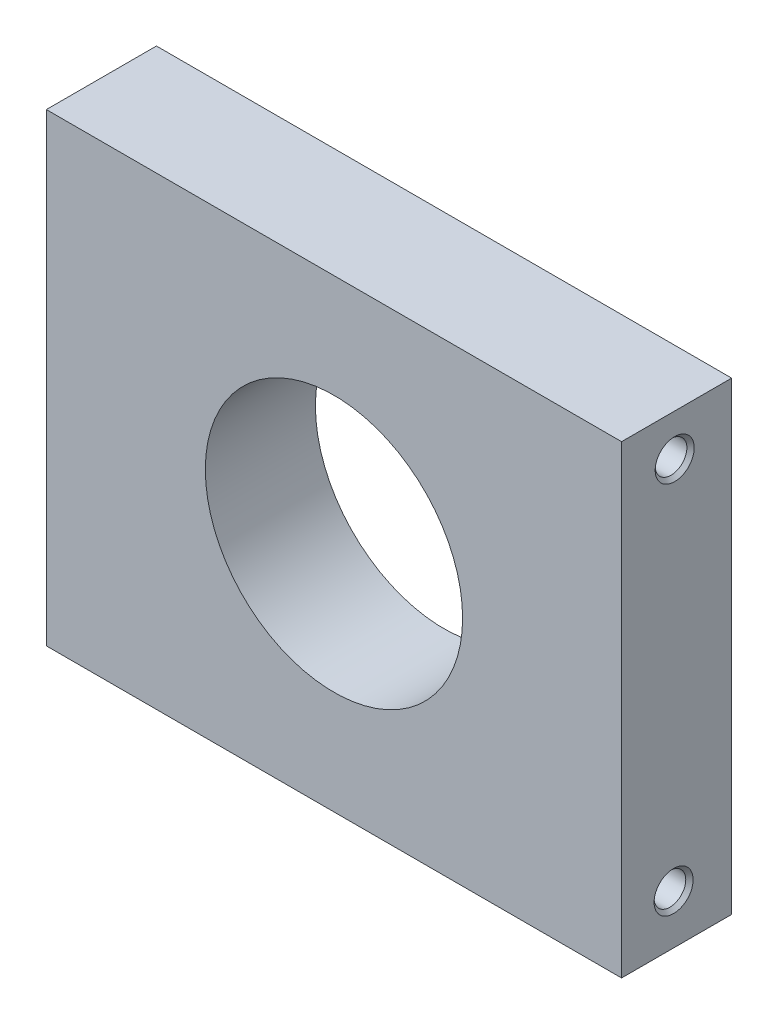
ISO-10303-21;
HEADER;
FILE_DESCRIPTION(('STEP AP214'),'2;1');
FILE_NAME('part.step','',(''),(''),'','','');
FILE_SCHEMA(('AUTOMOTIVE_DESIGN { 1 0 10303 214 1 1 1 1 }'));
ENDSEC;
DATA;
#1=APPLICATION_CONTEXT('core data for automotive mechanical design processes');
#2=APPLICATION_PROTOCOL_DEFINITION('international standard','automotive_design',2000,#1);
#3=PRODUCT_CONTEXT('',#1,'mechanical');
#4=PRODUCT('Part','Part','',(#3));
#5=PRODUCT_RELATED_PRODUCT_CATEGORY('part','',(#4));
#6=PRODUCT_DEFINITION_FORMATION('','',#4);
#7=PRODUCT_DEFINITION_CONTEXT('part definition',#1,'design');
#8=PRODUCT_DEFINITION('design','',#6,#7);
#9=PRODUCT_DEFINITION_SHAPE('','',#8);
#10=(LENGTH_UNIT() NAMED_UNIT(*) SI_UNIT(.MILLI.,.METRE.));
#11=(NAMED_UNIT(*) PLANE_ANGLE_UNIT() SI_UNIT($,.RADIAN.));
#12=(NAMED_UNIT(*) SI_UNIT($,.STERADIAN.) SOLID_ANGLE_UNIT());
#13=UNCERTAINTY_MEASURE_WITH_UNIT(LENGTH_MEASURE(1.E-05),#10,'distance_accuracy_value','');
#14=(GEOMETRIC_REPRESENTATION_CONTEXT(3) GLOBAL_UNCERTAINTY_ASSIGNED_CONTEXT((#13)) GLOBAL_UNIT_ASSIGNED_CONTEXT((#10,
#11,#12)) REPRESENTATION_CONTEXT('',''));
#15=CARTESIAN_POINT('',(0.,0.,0.));
#16=DIRECTION('',(0.,0.,1.));
#17=DIRECTION('',(1.,0.,0.));
#18=AXIS2_PLACEMENT_3D('',#15,#16,#17);
#19=CARTESIAN_POINT('',(49.7745362813437,40.1931410428469,19.05));
#20=DIRECTION('',(-1.,0.,0.));
#21=DIRECTION('',(0.,0.,1.));
#22=AXIS2_PLACEMENT_3D('',#19,#20,#21);
#23=PLANE('',#22);
#24=CARTESIAN_POINT('',(49.7745362813437,32.9849668910052,9.85722268811083));
#25=DIRECTION('',(1.,0.,0.));
#26=DIRECTION('',(0.,0.,-1.));
#27=AXIS2_PLACEMENT_3D('',#24,#25,#26);
#28=CIRCLE('',#27,3.3782);
#29=CARTESIAN_POINT('',(49.7745362813437,32.9849668910052,6.47902268811083));
#30=VERTEX_POINT('',#29);
#31=EDGE_CURVE('E128',#30,#30,#28,.T.);
#32=ORIENTED_EDGE('',*,*,#31,.F.);
#33=EDGE_LOOP('',(#32));
#34=FACE_BOUND('',#33,.T.);
#35=CARTESIAN_POINT('',(49.7745362813437,-31.6560761385612,10.0470642241742));
#36=DIRECTION('',(1.,0.,0.));
#37=DIRECTION('',(0.,0.,-1.));
#38=AXIS2_PLACEMENT_3D('',#35,#36,#37);
#39=CIRCLE('',#38,3.3782);
#40=CARTESIAN_POINT('',(49.7745362813437,-31.6560761385612,6.66886422417417));
#41=VERTEX_POINT('',#40);
#42=EDGE_CURVE('E119',#41,#41,#39,.T.);
#43=ORIENTED_EDGE('',*,*,#42,.F.);
#44=EDGE_LOOP('',(#43));
#45=FACE_BOUND('',#44,.T.);
#46=DIRECTION('',(0.,1.,0.));
#47=VECTOR('',#46,1.);
#48=CARTESIAN_POINT('',(49.7745362813437,40.1931410428469,0.));
#49=LINE('',#48,#47);
#50=CARTESIAN_POINT('',(49.7745362813437,-40.1931410428469,0.));
#51=VERTEX_POINT('',#50);
#52=CARTESIAN_POINT('',(49.7745362813437,40.1931410428469,0.));
#53=VERTEX_POINT('',#52);
#54=EDGE_CURVE('E94',#51,#53,#49,.T.);
#55=ORIENTED_EDGE('',*,*,#54,.T.);
#56=DIRECTION('',(0.,0.,-1.));
#57=VECTOR('',#56,1.);
#58=CARTESIAN_POINT('',(49.7745362813437,40.1931410428469,19.05));
#59=LINE('',#58,#57);
#60=CARTESIAN_POINT('',(49.7745362813437,40.1931410428469,19.05));
#61=VERTEX_POINT('',#60);
#62=EDGE_CURVE('E11',#61,#53,#59,.T.);
#63=ORIENTED_EDGE('',*,*,#62,.F.);
#64=DIRECTION('',(0.,1.,0.));
#65=VECTOR('',#64,1.);
#66=CARTESIAN_POINT('',(49.7745362813437,40.1931410428469,19.05));
#67=LINE('',#66,#65);
#68=CARTESIAN_POINT('',(49.7745362813437,-40.1931410428469,19.05));
#69=VERTEX_POINT('',#68);
#70=EDGE_CURVE('E82',#69,#61,#67,.T.);
#71=ORIENTED_EDGE('',*,*,#70,.F.);
#72=DIRECTION('',(0.,0.,-1.));
#73=VECTOR('',#72,1.);
#74=CARTESIAN_POINT('',(49.7745362813437,-40.1931410428469,19.05));
#75=LINE('',#74,#73);
#76=EDGE_CURVE('E90',#69,#51,#75,.T.);
#77=ORIENTED_EDGE('',*,*,#76,.T.);
#78=EDGE_LOOP('',(#55,#63,#71,#77));
#79=FACE_BOUND('',#78,.T.);
#80=ADVANCED_FACE('F31',(#34,#45,#79),#23,.F.);
#81=CARTESIAN_POINT('',(-49.7745362813437,40.1931410428469,19.05));
#82=DIRECTION('',(0.,-1.,0.));
#83=DIRECTION('',(0.,0.,-1.));
#84=AXIS2_PLACEMENT_3D('',#81,#82,#83);
#85=PLANE('',#84);
#86=DIRECTION('',(-1.,0.,0.));
#87=VECTOR('',#86,1.);
#88=CARTESIAN_POINT('',(-49.7745362813437,40.1931410428469,0.));
#89=LINE('',#88,#87);
#90=CARTESIAN_POINT('',(-49.7745362813437,40.1931410428469,0.));
#91=VERTEX_POINT('',#90);
#92=EDGE_CURVE('E86',#53,#91,#89,.T.);
#93=ORIENTED_EDGE('',*,*,#92,.T.);
#94=DIRECTION('',(0.,0.,-1.));
#95=VECTOR('',#94,1.);
#96=CARTESIAN_POINT('',(-49.7745362813437,40.1931410428469,19.05));
#97=LINE('',#96,#95);
#98=CARTESIAN_POINT('',(-49.7745362813437,40.1931410428469,19.05));
#99=VERTEX_POINT('',#98);
#100=EDGE_CURVE('E39',#99,#91,#97,.T.);
#101=ORIENTED_EDGE('',*,*,#100,.F.);
#102=DIRECTION('',(-1.,0.,0.));
#103=VECTOR('',#102,1.);
#104=CARTESIAN_POINT('',(-49.7745362813437,40.1931410428469,19.05));
#105=LINE('',#104,#103);
#106=EDGE_CURVE('E77',#61,#99,#105,.T.);
#107=ORIENTED_EDGE('',*,*,#106,.F.);
#108=ORIENTED_EDGE('',*,*,#62,.T.);
#109=EDGE_LOOP('',(#93,#101,#107,#108));
#110=FACE_BOUND('',#109,.T.);
#111=ADVANCED_FACE('F85',(#110),#85,.F.);
#112=CARTESIAN_POINT('',(-49.7745362813437,40.1931410428469,19.05));
#113=DIRECTION('',(1.,0.,0.));
#114=DIRECTION('',(0.,0.,-1.));
#115=AXIS2_PLACEMENT_3D('',#112,#113,#114);
#116=PLANE('',#115);
#117=CARTESIAN_POINT('',(-49.7745362813437,32.9849668910052,9.85722268811083));
#118=DIRECTION('',(1.,0.,0.));
#119=DIRECTION('',(0.,0.,-1.));
#120=AXIS2_PLACEMENT_3D('',#117,#118,#119);
#121=CIRCLE('',#120,2.74319999999997);
#122=CARTESIAN_POINT('',(-49.7745362813437,32.9849668910052,7.11402268811086));
#123=VERTEX_POINT('',#122);
#124=EDGE_CURVE('E122',#123,#123,#121,.T.);
#125=ORIENTED_EDGE('',*,*,#124,.T.);
#126=EDGE_LOOP('',(#125));
#127=FACE_BOUND('',#126,.T.);
#128=CARTESIAN_POINT('',(-49.7745362813437,-31.6560761385612,10.0470642241742));
#129=DIRECTION('',(1.,0.,0.));
#130=DIRECTION('',(0.,0.,-1.));
#131=AXIS2_PLACEMENT_3D('',#128,#129,#130);
#132=CIRCLE('',#131,2.74319999999998);
#133=CARTESIAN_POINT('',(-49.7745362813437,-31.6560761385612,7.3038642241742));
#134=VERTEX_POINT('',#133);
#135=EDGE_CURVE('E111',#134,#134,#132,.T.);
#136=ORIENTED_EDGE('',*,*,#135,.T.);
#137=EDGE_LOOP('',(#136));
#138=FACE_BOUND('',#137,.T.);
#139=DIRECTION('',(0.,-1.,0.));
#140=VECTOR('',#139,1.);
#141=CARTESIAN_POINT('',(-49.7745362813437,40.1931410428469,0.));
#142=LINE('',#141,#140);
#143=CARTESIAN_POINT('',(-49.7745362813437,-40.1931410428469,0.));
#144=VERTEX_POINT('',#143);
#145=EDGE_CURVE('E64',#91,#144,#142,.T.);
#146=ORIENTED_EDGE('',*,*,#145,.T.);
#147=DIRECTION('',(0.,0.,-1.));
#148=VECTOR('',#147,1.);
#149=CARTESIAN_POINT('',(-49.7745362813437,-40.1931410428469,19.05));
#150=LINE('',#149,#148);
#151=CARTESIAN_POINT('',(-49.7745362813437,-40.1931410428469,19.05));
#152=VERTEX_POINT('',#151);
#153=EDGE_CURVE('E87',#152,#144,#150,.T.);
#154=ORIENTED_EDGE('',*,*,#153,.F.);
#155=DIRECTION('',(0.,-1.,0.));
#156=VECTOR('',#155,1.);
#157=CARTESIAN_POINT('',(-49.7745362813437,40.1931410428469,19.05));
#158=LINE('',#157,#156);
#159=EDGE_CURVE('E80',#99,#152,#158,.T.);
#160=ORIENTED_EDGE('',*,*,#159,.F.);
#161=ORIENTED_EDGE('',*,*,#100,.T.);
#162=EDGE_LOOP('',(#146,#154,#160,#161));
#163=FACE_BOUND('',#162,.T.);
#164=ADVANCED_FACE('F88',(#127,#138,#163),#116,.F.);
#165=CARTESIAN_POINT('',(-49.7745362813437,-40.1931410428469,19.05));
#166=DIRECTION('',(0.,1.,0.));
#167=DIRECTION('',(0.,0.,1.));
#168=AXIS2_PLACEMENT_3D('',#165,#166,#167);
#169=PLANE('',#168);
#170=DIRECTION('',(1.,0.,0.));
#171=VECTOR('',#170,1.);
#172=CARTESIAN_POINT('',(-49.7745362813437,-40.1931410428469,0.));
#173=LINE('',#172,#171);
#174=EDGE_CURVE('E70',#144,#51,#173,.T.);
#175=ORIENTED_EDGE('',*,*,#174,.T.);
#176=ORIENTED_EDGE('',*,*,#76,.F.);
#177=DIRECTION('',(1.,0.,0.));
#178=VECTOR('',#177,1.);
#179=CARTESIAN_POINT('',(-49.7745362813437,-40.1931410428469,19.05));
#180=LINE('',#179,#178);
#181=EDGE_CURVE('E47',#152,#69,#180,.T.);
#182=ORIENTED_EDGE('',*,*,#181,.F.);
#183=ORIENTED_EDGE('',*,*,#153,.T.);
#184=EDGE_LOOP('',(#175,#176,#182,#183));
#185=FACE_BOUND('',#184,.T.);
#186=ADVANCED_FACE('F102',(#185),#169,.F.);
#187=CARTESIAN_POINT('',(49.7745362813437,-40.1931410428469,19.05));
#188=DIRECTION('',(0.,0.,1.));
#189=DIRECTION('',(1.,0.,0.));
#190=AXIS2_PLACEMENT_3D('',#187,#188,#189);
#191=PLANE('',#190);
#192=CARTESIAN_POINT('',(0.,0.,19.05));
#193=DIRECTION('',(0.,0.,1.));
#194=DIRECTION('',(1.,0.,0.));
#195=AXIS2_PLACEMENT_3D('',#192,#193,#194);
#196=CIRCLE('',#195,22.2631);
#197=CARTESIAN_POINT('',(22.2631,0.,19.05));
#198=VERTEX_POINT('',#197);
#199=EDGE_CURVE('E108',#198,#198,#196,.T.);
#200=ORIENTED_EDGE('',*,*,#199,.F.);
#201=EDGE_LOOP('',(#200));
#202=FACE_BOUND('',#201,.T.);
#203=ORIENTED_EDGE('',*,*,#70,.T.);
#204=ORIENTED_EDGE('',*,*,#106,.T.);
#205=ORIENTED_EDGE('',*,*,#159,.T.);
#206=ORIENTED_EDGE('',*,*,#181,.T.);
#207=EDGE_LOOP('',(#203,#204,#205,#206));
#208=FACE_BOUND('',#207,.T.);
#209=ADVANCED_FACE('F78',(#202,#208),#191,.T.);
#210=CARTESIAN_POINT('',(49.7745362813437,-40.1931410428469,0.));
#211=DIRECTION('',(0.,0.,1.));
#212=DIRECTION('',(1.,0.,0.));
#213=AXIS2_PLACEMENT_3D('',#210,#211,#212);
#214=PLANE('',#213);
#215=CARTESIAN_POINT('',(0.,0.,0.));
#216=DIRECTION('',(0.,0.,1.));
#217=DIRECTION('',(1.,0.,0.));
#218=AXIS2_PLACEMENT_3D('',#215,#216,#217);
#219=CIRCLE('',#218,22.2631);
#220=CARTESIAN_POINT('',(22.2631,0.,0.));
#221=VERTEX_POINT('',#220);
#222=EDGE_CURVE('E97',#221,#221,#219,.T.);
#223=ORIENTED_EDGE('',*,*,#222,.T.);
#224=EDGE_LOOP('',(#223));
#225=FACE_BOUND('',#224,.T.);
#226=ORIENTED_EDGE('',*,*,#54,.F.);
#227=ORIENTED_EDGE('',*,*,#174,.F.);
#228=ORIENTED_EDGE('',*,*,#145,.F.);
#229=ORIENTED_EDGE('',*,*,#92,.F.);
#230=EDGE_LOOP('',(#226,#227,#228,#229));
#231=FACE_BOUND('',#230,.T.);
#232=ADVANCED_FACE('F105',(#225,#231),#214,.F.);
#233=CARTESIAN_POINT('',(0.,0.,0.));
#234=DIRECTION('',(0.,0.,1.));
#235=DIRECTION('',(1.,0.,0.));
#236=AXIS2_PLACEMENT_3D('',#233,#234,#235);
#237=CYLINDRICAL_SURFACE('',#236,22.2631);
#238=ORIENTED_EDGE('',*,*,#222,.F.);
#239=EDGE_LOOP('',(#238));
#240=FACE_BOUND('',#239,.T.);
#241=ORIENTED_EDGE('',*,*,#199,.T.);
#242=EDGE_LOOP('',(#241));
#243=FACE_BOUND('',#242,.T.);
#244=ADVANCED_FACE('F150',(#240,#243),#237,.F.);
#245=CARTESIAN_POINT('',(49.7745362813437,-31.6560761385612,10.0470642241742));
#246=DIRECTION('',(1.,0.,0.));
#247=DIRECTION('',(0.,0.,-1.));
#248=AXIS2_PLACEMENT_3D('',#245,#246,#247);
#249=CYLINDRICAL_SURFACE('',#248,2.74319999999999);
#250=ORIENTED_EDGE('',*,*,#135,.F.);
#251=EDGE_LOOP('',(#250));
#252=FACE_BOUND('',#251,.T.);
#253=CARTESIAN_POINT('',(49.1395362813436,-31.6560761385612,10.0470642241742));
#254=DIRECTION('',(1.,0.,0.));
#255=DIRECTION('',(0.,0.,-1.));
#256=AXIS2_PLACEMENT_3D('',#253,#254,#255);
#257=CIRCLE('',#256,2.7432);
#258=CARTESIAN_POINT('',(49.1395362813436,-31.6560761385612,7.30386422417417));
#259=VERTEX_POINT('',#258);
#260=EDGE_CURVE('E116',#259,#259,#257,.T.);
#261=ORIENTED_EDGE('',*,*,#260,.T.);
#262=EDGE_LOOP('',(#261));
#263=FACE_BOUND('',#262,.T.);
#264=ADVANCED_FACE('F141',(#252,#263),#249,.F.);
#265=CARTESIAN_POINT('',(49.7745362813437,-31.6560761385612,10.0470642241742));
#266=DIRECTION('',(1.,0.,0.));
#267=DIRECTION('',(0.,0.,-1.));
#268=AXIS2_PLACEMENT_3D('',#265,#266,#267);
#269=CONICAL_SURFACE('',#268,3.3782,0.785398163397364);
#270=ORIENTED_EDGE('',*,*,#260,.F.);
#271=EDGE_LOOP('',(#270));
#272=FACE_BOUND('',#271,.T.);
#273=ORIENTED_EDGE('',*,*,#42,.T.);
#274=EDGE_LOOP('',(#273));
#275=FACE_BOUND('',#274,.T.);
#276=ADVANCED_FACE('F138',(#272,#275),#269,.F.);
#277=CARTESIAN_POINT('',(49.7745362813437,32.9849668910052,9.85722268811083));
#278=DIRECTION('',(1.,0.,0.));
#279=DIRECTION('',(0.,0.,-1.));
#280=AXIS2_PLACEMENT_3D('',#277,#278,#279);
#281=CYLINDRICAL_SURFACE('',#280,2.74319999999999);
#282=ORIENTED_EDGE('',*,*,#124,.F.);
#283=EDGE_LOOP('',(#282));
#284=FACE_BOUND('',#283,.T.);
#285=CARTESIAN_POINT('',(49.1395362813436,32.9849668910052,9.85722268811083));
#286=DIRECTION('',(1.,0.,0.));
#287=DIRECTION('',(0.,0.,-1.));
#288=AXIS2_PLACEMENT_3D('',#285,#286,#287);
#289=CIRCLE('',#288,2.7432);
#290=CARTESIAN_POINT('',(49.1395362813436,32.9849668910052,7.11402268811083));
#291=VERTEX_POINT('',#290);
#292=EDGE_CURVE('E125',#291,#291,#289,.T.);
#293=ORIENTED_EDGE('',*,*,#292,.T.);
#294=EDGE_LOOP('',(#293));
#295=FACE_BOUND('',#294,.T.);
#296=ADVANCED_FACE('F140',(#284,#295),#281,.F.);
#297=CARTESIAN_POINT('',(49.7745362813437,32.9849668910052,9.85722268811083));
#298=DIRECTION('',(1.,0.,0.));
#299=DIRECTION('',(0.,0.,-1.));
#300=AXIS2_PLACEMENT_3D('',#297,#298,#299);
#301=CONICAL_SURFACE('',#300,3.3782,0.785398163397361);
#302=ORIENTED_EDGE('',*,*,#292,.F.);
#303=EDGE_LOOP('',(#302));
#304=FACE_BOUND('',#303,.T.);
#305=ORIENTED_EDGE('',*,*,#31,.T.);
#306=EDGE_LOOP('',(#305));
#307=FACE_BOUND('',#306,.T.);
#308=ADVANCED_FACE('F132',(#304,#307),#301,.F.);
#309=CLOSED_SHELL('',(#80,#111,#164,#186,#209,#232,#244,#264,#276,#296,#308));
#310=MANIFOLD_SOLID_BREP('B2',#309);
#311=ADVANCED_BREP_SHAPE_REPRESENTATION('',(#18,#310),#14);
#312=SHAPE_DEFINITION_REPRESENTATION(#9,#311);
ENDSEC;
END-ISO-10303-21;
